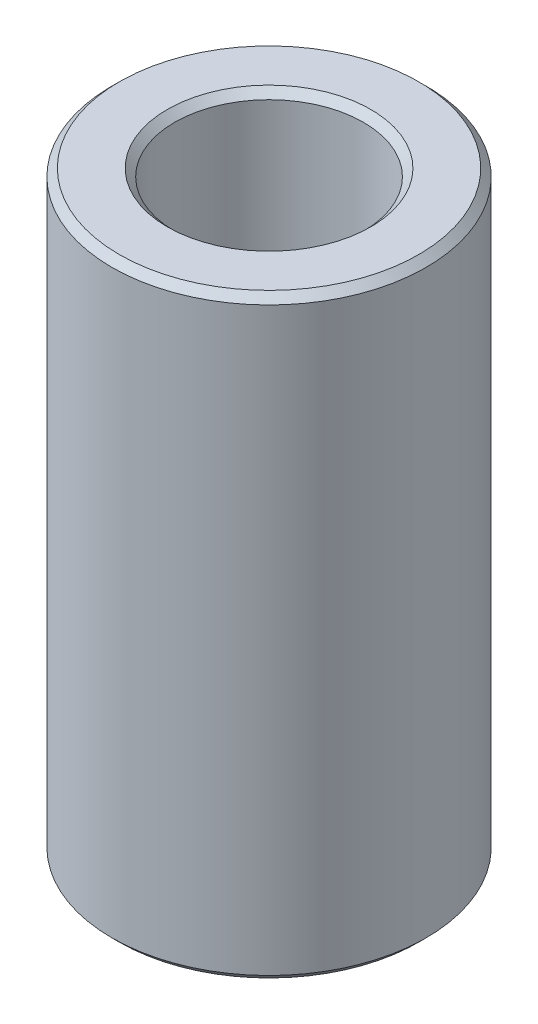
ISO-10303-21;
HEADER;
FILE_DESCRIPTION(('STEP AP214'),'2;1');
FILE_NAME('part.step','',(''),(''),'','','');
FILE_SCHEMA(('AUTOMOTIVE_DESIGN { 1 0 10303 214 1 1 1 1 }'));
ENDSEC;
DATA;
#1=APPLICATION_CONTEXT('core data for automotive mechanical design processes');
#2=APPLICATION_PROTOCOL_DEFINITION('international standard','automotive_design',2000,#1);
#3=PRODUCT_CONTEXT('',#1,'mechanical');
#4=PRODUCT('Part','Part','',(#3));
#5=PRODUCT_RELATED_PRODUCT_CATEGORY('part','',(#4));
#6=PRODUCT_DEFINITION_FORMATION('','',#4);
#7=PRODUCT_DEFINITION_CONTEXT('part definition',#1,'design');
#8=PRODUCT_DEFINITION('design','',#6,#7);
#9=PRODUCT_DEFINITION_SHAPE('','',#8);
#10=(LENGTH_UNIT() NAMED_UNIT(*) SI_UNIT(.MILLI.,.METRE.));
#11=(NAMED_UNIT(*) PLANE_ANGLE_UNIT() SI_UNIT($,.RADIAN.));
#12=(NAMED_UNIT(*) SI_UNIT($,.STERADIAN.) SOLID_ANGLE_UNIT());
#13=UNCERTAINTY_MEASURE_WITH_UNIT(LENGTH_MEASURE(1.E-05),#10,'distance_accuracy_value','');
#14=(GEOMETRIC_REPRESENTATION_CONTEXT(3) GLOBAL_UNCERTAINTY_ASSIGNED_CONTEXT((#13)) GLOBAL_UNIT_ASSIGNED_CONTEXT((#10,
#11,#12)) REPRESENTATION_CONTEXT('',''));
#15=CARTESIAN_POINT('',(0.,0.,0.));
#16=DIRECTION('',(0.,0.,1.));
#17=DIRECTION('',(1.,0.,0.));
#18=AXIS2_PLACEMENT_3D('',#15,#16,#17);
#19=CARTESIAN_POINT('',(0.,142.139565345139,0.));
#20=DIRECTION('',(0.,-1.,0.));
#21=DIRECTION('',(0.,0.,-1.));
#22=AXIS2_PLACEMENT_3D('',#19,#20,#21);
#23=CYLINDRICAL_SURFACE('',#22,37.5);
#24=CARTESIAN_POINT('',(0.,1.76689633926128,0.));
#25=DIRECTION('',(0.,1.,0.));
#26=DIRECTION('',(0.,0.,1.));
#27=AXIS2_PLACEMENT_3D('',#24,#25,#26);
#28=CIRCLE('',#27,37.5);
#29=CARTESIAN_POINT('',(0.,1.76689633926128,37.5));
#30=VERTEX_POINT('',#29);
#31=EDGE_CURVE('E10',#30,#30,#28,.T.);
#32=ORIENTED_EDGE('',*,*,#31,.T.);
#33=EDGE_LOOP('',(#32));
#34=FACE_BOUND('',#33,.T.);
#35=CARTESIAN_POINT('',(0.,140.372669005877,0.));
#36=DIRECTION('',(0.,1.,0.));
#37=DIRECTION('',(0.,0.,1.));
#38=AXIS2_PLACEMENT_3D('',#35,#36,#37);
#39=CIRCLE('',#38,37.5);
#40=CARTESIAN_POINT('',(0.,140.372669005877,37.5));
#41=VERTEX_POINT('',#40);
#42=EDGE_CURVE('E50',#41,#41,#39,.F.);
#43=ORIENTED_EDGE('',*,*,#42,.T.);
#44=EDGE_LOOP('',(#43));
#45=FACE_BOUND('',#44,.T.);
#46=ADVANCED_FACE('F39',(#34,#45),#23,.T.);
#47=CARTESIAN_POINT('',(0.,142.139565345139,0.));
#48=DIRECTION('',(0.,1.,0.));
#49=DIRECTION('',(0.,0.,1.));
#50=AXIS2_PLACEMENT_3D('',#47,#48,#49);
#51=PLANE('',#50);
#52=CARTESIAN_POINT('',(0.,142.139565345139,0.));
#53=DIRECTION('',(0.,1.,0.));
#54=DIRECTION('',(0.,0.,1.));
#55=AXIS2_PLACEMENT_3D('',#52,#53,#54);
#56=CIRCLE('',#55,24.2884294003026);
#57=CARTESIAN_POINT('',(0.,142.139565345139,24.2884294003026));
#58=VERTEX_POINT('',#57);
#59=EDGE_CURVE('E58',#58,#58,#56,.F.);
#60=ORIENTED_EDGE('',*,*,#59,.T.);
#61=EDGE_LOOP('',(#60));
#62=FACE_BOUND('',#61,.T.);
#63=CARTESIAN_POINT('',(0.,142.139565345139,0.));
#64=DIRECTION('',(0.,1.,0.));
#65=DIRECTION('',(0.,0.,1.));
#66=AXIS2_PLACEMENT_3D('',#63,#64,#65);
#67=CIRCLE('',#66,35.7331036607387);
#68=CARTESIAN_POINT('',(0.,142.139565345139,35.7331036607387));
#69=VERTEX_POINT('',#68);
#70=EDGE_CURVE('E61',#69,#69,#67,.T.);
#71=ORIENTED_EDGE('',*,*,#70,.T.);
#72=EDGE_LOOP('',(#71));
#73=FACE_BOUND('',#72,.T.);
#74=ADVANCED_FACE('F88',(#62,#73),#51,.T.);
#75=CARTESIAN_POINT('',(0.,0.,0.));
#76=DIRECTION('',(0.,1.,0.));
#77=DIRECTION('',(0.,0.,1.));
#78=AXIS2_PLACEMENT_3D('',#75,#76,#77);
#79=PLANE('',#78);
#80=CARTESIAN_POINT('',(0.,0.,0.));
#81=DIRECTION('',(0.,1.,0.));
#82=DIRECTION('',(0.,0.,1.));
#83=AXIS2_PLACEMENT_3D('',#80,#81,#82);
#84=CIRCLE('',#83,24.2884294003026);
#85=CARTESIAN_POINT('',(0.,0.,24.2884294003026));
#86=VERTEX_POINT('',#85);
#87=EDGE_CURVE('E51',#86,#86,#84,.T.);
#88=ORIENTED_EDGE('',*,*,#87,.T.);
#89=EDGE_LOOP('',(#88));
#90=FACE_BOUND('',#89,.T.);
#91=CARTESIAN_POINT('',(0.,0.,0.));
#92=DIRECTION('',(0.,1.,0.));
#93=DIRECTION('',(0.,0.,1.));
#94=AXIS2_PLACEMENT_3D('',#91,#92,#93);
#95=CIRCLE('',#94,35.7331036607387);
#96=CARTESIAN_POINT('',(0.,0.,35.7331036607387));
#97=VERTEX_POINT('',#96);
#98=EDGE_CURVE('E54',#97,#97,#95,.F.);
#99=ORIENTED_EDGE('',*,*,#98,.T.);
#100=EDGE_LOOP('',(#99));
#101=FACE_BOUND('',#100,.T.);
#102=ADVANCED_FACE('F83',(#90,#101),#79,.F.);
#103=CARTESIAN_POINT('',(0.,142.139565345139,0.));
#104=DIRECTION('',(0.,-1.,0.));
#105=DIRECTION('',(0.,0.,-1.));
#106=AXIS2_PLACEMENT_3D('',#103,#104,#105);
#107=CYLINDRICAL_SURFACE('',#106,22.5215330610413);
#108=CARTESIAN_POINT('',(0.,140.372669005877,0.));
#109=DIRECTION('',(0.,1.,0.));
#110=DIRECTION('',(0.,0.,1.));
#111=AXIS2_PLACEMENT_3D('',#108,#109,#110);
#112=CIRCLE('',#111,22.5215330610413);
#113=CARTESIAN_POINT('',(0.,140.372669005877,22.5215330610413));
#114=VERTEX_POINT('',#113);
#115=EDGE_CURVE('E67',#114,#114,#112,.T.);
#116=ORIENTED_EDGE('',*,*,#115,.T.);
#117=EDGE_LOOP('',(#116));
#118=FACE_BOUND('',#117,.T.);
#119=CARTESIAN_POINT('',(0.,1.7668963392613,0.));
#120=DIRECTION('',(0.,1.,0.));
#121=DIRECTION('',(0.,0.,1.));
#122=AXIS2_PLACEMENT_3D('',#119,#120,#121);
#123=CIRCLE('',#122,22.5215330610413);
#124=CARTESIAN_POINT('',(0.,1.7668963392613,22.5215330610413));
#125=VERTEX_POINT('',#124);
#126=EDGE_CURVE('E69',#125,#125,#123,.F.);
#127=ORIENTED_EDGE('',*,*,#126,.T.);
#128=EDGE_LOOP('',(#127));
#129=FACE_BOUND('',#128,.T.);
#130=ADVANCED_FACE('F71',(#118,#129),#107,.F.);
#131=CARTESIAN_POINT('',(0.,140.372669005877,0.));
#132=DIRECTION('',(0.,1.,0.));
#133=DIRECTION('',(0.,0.,1.));
#134=AXIS2_PLACEMENT_3D('',#131,#132,#133);
#135=CONICAL_SURFACE('',#134,22.5215330610413,0.785398163397446);
#136=CARTESIAN_POINT('',(0.,142.139565345139,24.2884294003026));
#137=CARTESIAN_POINT('',(0.,142.121160174938,24.2700242301019));
#138=CARTESIAN_POINT('',(0.,142.102755004737,24.2516190599013));
#139=CARTESIAN_POINT('',(0.,142.065944664336,24.2148087195));
#140=CARTESIAN_POINT('',(0.,142.047539494135,24.1964035492994));
#141=CARTESIAN_POINT('',(0.,142.010729153734,24.1595932088981));
#142=CARTESIAN_POINT('',(0.,141.992323983533,24.1411880386975));
#143=CARTESIAN_POINT('',(0.,141.955513643132,24.1043776982962));
#144=CARTESIAN_POINT('',(0.,141.937108472931,24.0859725280956));
#145=CARTESIAN_POINT('',(0.,141.90029813253,24.0491621876943));
#146=CARTESIAN_POINT('',(0.,141.88189296233,24.0307570174937));
#147=CARTESIAN_POINT('',(0.,141.845082621928,23.9939466770924));
#148=CARTESIAN_POINT('',(0.,141.826677451728,23.9755415068917));
#149=CARTESIAN_POINT('',(0.,141.789867111326,23.9387311664905));
#150=CARTESIAN_POINT('',(0.,141.771461941126,23.9203259962898));
#151=CARTESIAN_POINT('',(0.,141.734651600724,23.8835156558885));
#152=CARTESIAN_POINT('',(0.,141.716246430524,23.8651104856879));
#153=CARTESIAN_POINT('',(0.,141.679436090123,23.8283001452866));
#154=CARTESIAN_POINT('',(0.,141.661030919922,23.809894975086));
#155=CARTESIAN_POINT('',(0.,141.624220579521,23.7730846346847));
#156=CARTESIAN_POINT('',(0.,141.60581540932,23.7546794644841));
#157=CARTESIAN_POINT('',(0.,141.569005068919,23.7178691240828));
#158=CARTESIAN_POINT('',(0.,141.550599898718,23.6994639538822));
#159=CARTESIAN_POINT('',(0.,141.513789558317,23.6626536134809));
#160=CARTESIAN_POINT('',(0.,141.495384388116,23.6442484432803));
#161=CARTESIAN_POINT('',(0.,141.458574047715,23.607438102879));
#162=CARTESIAN_POINT('',(0.,141.440168877514,23.5890329326783));
#163=CARTESIAN_POINT('',(0.,141.403358537113,23.5522225922771));
#164=CARTESIAN_POINT('',(0.,141.384953366912,23.5338174220764));
#165=CARTESIAN_POINT('',(0.,141.348143026511,23.4970070816751));
#166=CARTESIAN_POINT('',(0.,141.32973785631,23.4786019114745));
#167=CARTESIAN_POINT('',(0.,141.292927515909,23.4417915710732));
#168=CARTESIAN_POINT('',(0.,141.274522345709,23.4233864008726));
#169=CARTESIAN_POINT('',(0.,141.237712005307,23.3865760604713));
#170=CARTESIAN_POINT('',(0.,141.219306835107,23.3681708902707));
#171=CARTESIAN_POINT('',(0.,141.182496494705,23.3313605498694));
#172=CARTESIAN_POINT('',(0.,141.164091324505,23.3129553796688));
#173=CARTESIAN_POINT('',(0.,141.127280984103,23.2761450392675));
#174=CARTESIAN_POINT('',(0.,141.108875813903,23.2577398690668));
#175=CARTESIAN_POINT('',(0.,141.072065473501,23.2209295286656));
#176=CARTESIAN_POINT('',(0.,141.053660303301,23.2025243584649));
#177=CARTESIAN_POINT('',(0.,141.0168499629,23.1657140180637));
#178=CARTESIAN_POINT('',(0.,140.998444792699,23.147308847863));
#179=CARTESIAN_POINT('',(0.,140.961634452298,23.1104985074617));
#180=CARTESIAN_POINT('',(0.,140.943229282097,23.0920933372611));
#181=CARTESIAN_POINT('',(0.,140.906418941696,23.0552829968598));
#182=CARTESIAN_POINT('',(0.,140.888013771495,23.0368778266592));
#183=CARTESIAN_POINT('',(0.,140.851203431094,23.0000674862579));
#184=CARTESIAN_POINT('',(0.,140.832798260893,22.9816623160573));
#185=CARTESIAN_POINT('',(0.,140.795987920492,22.944851975656));
#186=CARTESIAN_POINT('',(0.,140.777582750291,22.9264468054554));
#187=CARTESIAN_POINT('',(0.,140.74077240989,22.8896364650541));
#188=CARTESIAN_POINT('',(0.,140.722367239689,22.8712312948534));
#189=CARTESIAN_POINT('',(0.,140.685556899288,22.8344209544522));
#190=CARTESIAN_POINT('',(0.,140.667151729087,22.8160157842515));
#191=CARTESIAN_POINT('',(0.,140.630341388686,22.7792054438503));
#192=CARTESIAN_POINT('',(0.,140.611936218486,22.7608002736496));
#193=CARTESIAN_POINT('',(0.,140.575125878084,22.7239899332483));
#194=CARTESIAN_POINT('',(0.,140.556720707884,22.7055847630477));
#195=CARTESIAN_POINT('',(0.,140.519910367482,22.6687744226464));
#196=CARTESIAN_POINT('',(0.,140.501505197282,22.6503692524458));
#197=CARTESIAN_POINT('',(0.,140.46469485688,22.6135589120445));
#198=CARTESIAN_POINT('',(0.,140.44628968668,22.5951537418439));
#199=CARTESIAN_POINT('',(0.,140.409479346279,22.5583434014426));
#200=CARTESIAN_POINT('',(0.,140.391074176078,22.539938231242));
#201=CARTESIAN_POINT('',(0.,140.372669005877,22.5215330610413));
#202=B_SPLINE_CURVE_WITH_KNOTS('',3,(#136,#137,#138,#139,#140,#141,#142,#143,#144,#145,#146,
#147,#148,#149,#150,#151,#152,#153,#154,#155,#156,#157,#158,#159,#160,#161,#162,#163,#164,#165,
#166,#167,#168,#169,#170,#171,#172,#173,#174,#175,#176,#177,#178,#179,#180,#181,#182,#183,#184,
#185,#186,#187,#188,#189,#190,#191,#192,#193,#194,#195,#196,#197,#198,#199,#200,#201),
.UNSPECIFIED.,.F.,.F.,(4,2,2,2,2,2,2,2,2,2,2,2,2,2,2,2,2,2,2,2,2,2,2,2,2,2,2,2,2,2,2,2,4),(0.,
0.0780865239465871,0.156173047893172,0.234259571839759,0.312346095786346,0.390432619732931,
0.468519143679518,0.546605667626085,0.62469219157267,0.702778715519257,0.780865239465844,
0.858951763412429,0.937038287359016,1.01512481130558,1.09321133525217,1.17129785919875,
1.24938438314534,1.32747090709193,1.40555743103851,1.4836439549851,1.56173047893167,
1.63981700287825,1.71790352682484,1.79599005077143,1.87407657471801,1.9521630986646,
2.03024962261117,2.10833614655775,2.18642267050434,2.26450919445093,2.34259571839751,
2.4206822423441,2.49876876629066),.UNSPECIFIED.);
#203=EDGE_CURVE('BSEAM77',#58,#114,#202,.T.);
#204=ORIENTED_EDGE('',*,*,#59,.F.);
#205=ORIENTED_EDGE('',*,*,#115,.F.);
#206=ORIENTED_EDGE('',*,*,#203,.T.);
#207=ORIENTED_EDGE('',*,*,#203,.F.);
#208=EDGE_LOOP('',(#204,#206,#205,#207));
#209=FACE_BOUND('',#208,.T.);
#210=ADVANCED_FACE('F77',(#209),#135,.F.);
#211=CARTESIAN_POINT('',(0.,0.,0.));
#212=DIRECTION('',(0.,-1.,0.));
#213=DIRECTION('',(0.,0.,-1.));
#214=AXIS2_PLACEMENT_3D('',#211,#212,#213);
#215=CONICAL_SURFACE('',#214,24.2884294003026,0.785398163397444);
#216=ORIENTED_EDGE('',*,*,#126,.F.);
#217=EDGE_LOOP('',(#216));
#218=FACE_BOUND('',#217,.T.);
#219=ORIENTED_EDGE('',*,*,#87,.F.);
#220=EDGE_LOOP('',(#219));
#221=FACE_BOUND('',#220,.T.);
#222=ADVANCED_FACE('F73',(#218,#221),#215,.F.);
#223=CARTESIAN_POINT('',(0.,1.76689633926128,0.));
#224=DIRECTION('',(0.,1.,0.));
#225=DIRECTION('',(0.,0.,1.));
#226=AXIS2_PLACEMENT_3D('',#223,#224,#225);
#227=CONICAL_SURFACE('',#226,37.5,0.785398163397452);
#228=CARTESIAN_POINT('',(0.,0.,35.7331036607387));
#229=CARTESIAN_POINT('',(0.,0.01840517020064,35.7515088309394));
#230=CARTESIAN_POINT('',(0.,0.0368103404012776,35.76991400114));
#231=CARTESIAN_POINT('',(0.,0.0736206808025529,35.8067243415413));
#232=CARTESIAN_POINT('',(0.,0.0920258510031905,35.8251295117419));
#233=CARTESIAN_POINT('',(0.,0.128836191404467,35.8619398521432));
#234=CARTESIAN_POINT('',(0.,0.147241361605107,35.8803450223438));
#235=CARTESIAN_POINT('',(0.,0.184051702006383,35.9171553627451));
#236=CARTESIAN_POINT('',(0.,0.20245687220702,35.9355605329457));
#237=CARTESIAN_POINT('',(0.,0.239267212608297,35.972370873347));
#238=CARTESIAN_POINT('',(0.,0.257672382808936,35.9907760435477));
#239=CARTESIAN_POINT('',(0.,0.294482723210213,36.0275863839489));
#240=CARTESIAN_POINT('',(0.,0.31288789341085,36.0459915541496));
#241=CARTESIAN_POINT('',(0.,0.349698233812126,36.0828018945508));
#242=CARTESIAN_POINT('',(0.,0.368103404012765,36.1012070647515));
#243=CARTESIAN_POINT('',(0.,0.404913744414043,36.1380174051528));
#244=CARTESIAN_POINT('',(0.,0.423318914614681,36.1564225753534));
#245=CARTESIAN_POINT('',(0.,0.460129255015957,36.1932329157547));
#246=CARTESIAN_POINT('',(0.,0.478534425216595,36.2116380859553));
#247=CARTESIAN_POINT('',(0.,0.515344765617871,36.2484484263566));
#248=CARTESIAN_POINT('',(0.,0.533749935818511,36.2668535965572));
#249=CARTESIAN_POINT('',(0.,0.570560276219787,36.3036639369585));
#250=CARTESIAN_POINT('',(0.,0.588965446420424,36.3220691071591));
#251=CARTESIAN_POINT('',(0.,0.625775786821701,36.3588794475604));
#252=CARTESIAN_POINT('',(0.,0.644180957022341,36.3772846177611));
#253=CARTESIAN_POINT('',(0.,0.680991297423617,36.4140949581623));
#254=CARTESIAN_POINT('',(0.,0.699396467624254,36.432500128363));
#255=CARTESIAN_POINT('',(0.,0.736206808025531,36.4693104687643));
#256=CARTESIAN_POINT('',(0.,0.75461197822617,36.4877156389649));
#257=CARTESIAN_POINT('',(0.,0.791422318627447,36.5245259793662));
#258=CARTESIAN_POINT('',(0.,0.809827488828084,36.5429311495668));
#259=CARTESIAN_POINT('',(0.,0.84663782922936,36.5797414899681));
#260=CARTESIAN_POINT('',(0.,0.865042999429999,36.5981466601687));
#261=CARTESIAN_POINT('',(0.,0.901853339831276,36.63495700057));
#262=CARTESIAN_POINT('',(0.,0.920258510031915,36.6533621707706));
#263=CARTESIAN_POINT('',(0.,0.957068850433191,36.6901725111719));
#264=CARTESIAN_POINT('',(0.,0.975474020633829,36.7085776813726));
#265=CARTESIAN_POINT('',(0.,1.01228436103511,36.7453880217738));
#266=CARTESIAN_POINT('',(0.,1.03068953123574,36.7637931919745));
#267=CARTESIAN_POINT('',(0.,1.06749987163702,36.8006035323757));
#268=CARTESIAN_POINT('',(0.,1.08590504183766,36.8190087025764));
#269=CARTESIAN_POINT('',(0.,1.12271538223894,36.8558190429777));
#270=CARTESIAN_POINT('',(0.,1.14112055243957,36.8742242131783));
#271=CARTESIAN_POINT('',(0.,1.17793089284085,36.9110345535796));
#272=CARTESIAN_POINT('',(0.,1.19633606304149,36.9294397237802));
#273=CARTESIAN_POINT('',(0.,1.23314640344276,36.9662500641815));
#274=CARTESIAN_POINT('',(0.,1.2515515736434,36.9846552343821));
#275=CARTESIAN_POINT('',(0.,1.28836191404468,37.0214655747834));
#276=CARTESIAN_POINT('',(0.,1.30676708424532,37.0398707449841));
#277=CARTESIAN_POINT('',(0.,1.34357742464659,37.0766810853853));
#278=CARTESIAN_POINT('',(0.,1.36198259484723,37.095086255586));
#279=CARTESIAN_POINT('',(0.,1.39879293524851,37.1318965959872));
#280=CARTESIAN_POINT('',(0.,1.41719810544915,37.1503017661879));
#281=CARTESIAN_POINT('',(0.,1.45400844585042,37.1871121065891));
#282=CARTESIAN_POINT('',(0.,1.47241361605106,37.2055172767898));
#283=CARTESIAN_POINT('',(0.,1.50922395645234,37.2423276171911));
#284=CARTESIAN_POINT('',(0.,1.52762912665298,37.2607327873917));
#285=CARTESIAN_POINT('',(0.,1.56443946705426,37.297543127793));
#286=CARTESIAN_POINT('',(0.,1.58284463725489,37.3159482979936));
#287=CARTESIAN_POINT('',(0.,1.61965497765617,37.3527586383949));
#288=CARTESIAN_POINT('',(0.,1.63806014785681,37.3711638085955));
#289=CARTESIAN_POINT('',(0.,1.67487048825808,37.4079741489968));
#290=CARTESIAN_POINT('',(0.,1.69327565845872,37.4263793191975));
#291=CARTESIAN_POINT('',(0.,1.73008599886,37.4631896595987));
#292=CARTESIAN_POINT('',(0.,1.74849116906064,37.4815948297994));
#293=CARTESIAN_POINT('',(0.,1.76689633926128,37.5));
#294=B_SPLINE_CURVE_WITH_KNOTS('',3,(#228,#229,#230,#231,#232,#233,#234,#235,#236,#237,#238,
#239,#240,#241,#242,#243,#244,#245,#246,#247,#248,#249,#250,#251,#252,#253,#254,#255,#256,#257,
#258,#259,#260,#261,#262,#263,#264,#265,#266,#267,#268,#269,#270,#271,#272,#273,#274,#275,#276,
#277,#278,#279,#280,#281,#282,#283,#284,#285,#286,#287,#288,#289,#290,#291,#292,#293),
.UNSPECIFIED.,.F.,.F.,(4,2,2,2,2,2,2,2,2,2,2,2,2,2,2,2,2,2,2,2,2,2,2,2,2,2,2,2,2,2,2,2,4),(0.,
0.0780865239465816,0.156173047893168,0.23425957183975,0.312346095786336,0.390432619732918,
0.468519143679504,0.546605667626086,0.624692191572667,0.702778715519254,0.780865239465835,
0.858951763412422,0.937038287359004,1.01512481130559,1.09321133525217,1.17129785919876,
1.24938438314534,1.32747090709192,1.40555743103851,1.48364395498509,1.56173047893168,
1.63981700287826,1.71790352682484,1.79599005077143,1.87407657471801,1.95216309866459,
2.03024962261118,2.10833614655776,2.18642267050434,2.26450919445093,2.34259571839751,
2.4206822423441,2.49876876629068),.UNSPECIFIED.);
#295=EDGE_CURVE('BSEAM76',#97,#30,#294,.T.);
#296=ORIENTED_EDGE('',*,*,#98,.F.);
#297=ORIENTED_EDGE('',*,*,#31,.F.);
#298=ORIENTED_EDGE('',*,*,#295,.T.);
#299=ORIENTED_EDGE('',*,*,#295,.F.);
#300=EDGE_LOOP('',(#296,#298,#297,#299));
#301=FACE_BOUND('',#300,.T.);
#302=ADVANCED_FACE('F76',(#301),#227,.T.);
#303=CARTESIAN_POINT('',(0.,142.139565345139,0.));
#304=DIRECTION('',(0.,-1.,0.));
#305=DIRECTION('',(0.,0.,-1.));
#306=AXIS2_PLACEMENT_3D('',#303,#304,#305);
#307=CONICAL_SURFACE('',#306,35.7331036607387,0.785398163397441);
#308=ORIENTED_EDGE('',*,*,#42,.F.);
#309=EDGE_LOOP('',(#308));
#310=FACE_BOUND('',#309,.T.);
#311=ORIENTED_EDGE('',*,*,#70,.F.);
#312=EDGE_LOOP('',(#311));
#313=FACE_BOUND('',#312,.T.);
#314=ADVANCED_FACE('F45',(#310,#313),#307,.T.);
#315=CLOSED_SHELL('',(#46,#74,#102,#130,#210,#222,#302,#314));
#316=MANIFOLD_SOLID_BREP('B2',#315);
#317=ADVANCED_BREP_SHAPE_REPRESENTATION('',(#18,#316),#14);
#318=SHAPE_DEFINITION_REPRESENTATION(#9,#317);
ENDSEC;
END-ISO-10303-21;
